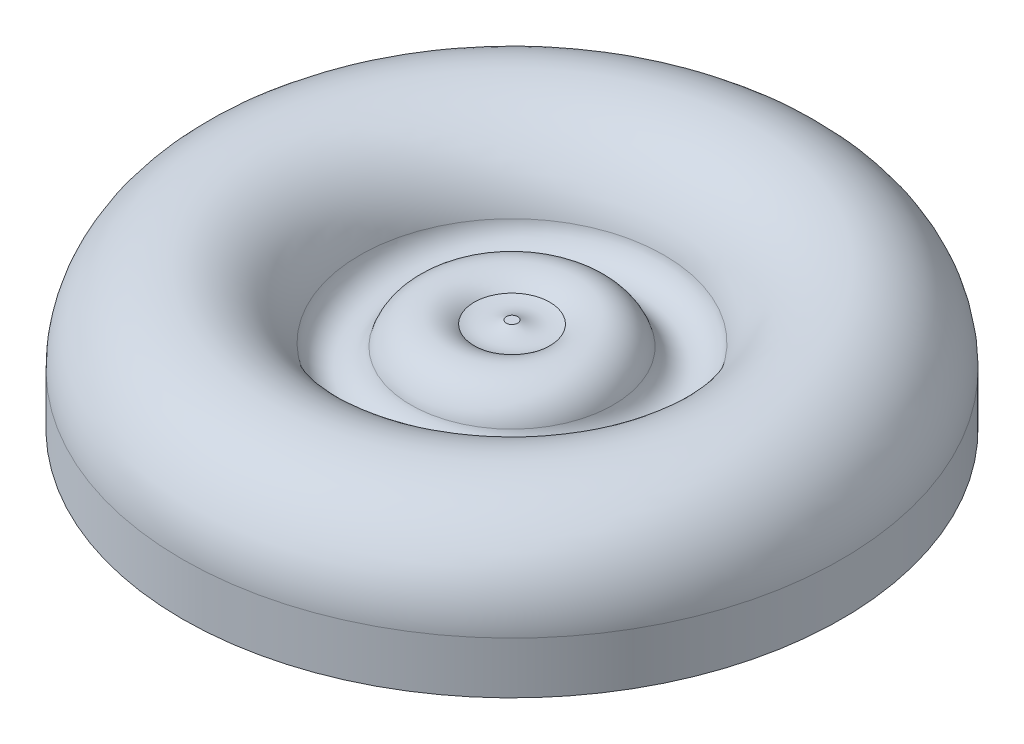
ISO-10303-21;
HEADER;
FILE_DESCRIPTION(('STEP AP214'),'2;1');
FILE_NAME('part.step','',(''),(''),'','','');
FILE_SCHEMA(('AUTOMOTIVE_DESIGN { 1 0 10303 214 1 1 1 1 }'));
ENDSEC;
DATA;
#1=APPLICATION_CONTEXT('core data for automotive mechanical design processes');
#2=APPLICATION_PROTOCOL_DEFINITION('international standard','automotive_design',2000,#1);
#3=PRODUCT_CONTEXT('',#1,'mechanical');
#4=PRODUCT('Part','Part','',(#3));
#5=PRODUCT_RELATED_PRODUCT_CATEGORY('part','',(#4));
#6=PRODUCT_DEFINITION_FORMATION('','',#4);
#7=PRODUCT_DEFINITION_CONTEXT('part definition',#1,'design');
#8=PRODUCT_DEFINITION('design','',#6,#7);
#9=PRODUCT_DEFINITION_SHAPE('','',#8);
#10=(LENGTH_UNIT() NAMED_UNIT(*) SI_UNIT(.MILLI.,.METRE.));
#11=(NAMED_UNIT(*) PLANE_ANGLE_UNIT() SI_UNIT($,.RADIAN.));
#12=(NAMED_UNIT(*) SI_UNIT($,.STERADIAN.) SOLID_ANGLE_UNIT());
#13=UNCERTAINTY_MEASURE_WITH_UNIT(LENGTH_MEASURE(1.E-05),#10,'distance_accuracy_value','');
#14=(GEOMETRIC_REPRESENTATION_CONTEXT(3) GLOBAL_UNCERTAINTY_ASSIGNED_CONTEXT((#13)) GLOBAL_UNIT_ASSIGNED_CONTEXT((#10,
#11,#12)) REPRESENTATION_CONTEXT('',''));
#15=CARTESIAN_POINT('',(0.,0.,0.));
#16=DIRECTION('',(0.,0.,1.));
#17=DIRECTION('',(1.,0.,0.));
#18=AXIS2_PLACEMENT_3D('',#15,#16,#17);
#19=CARTESIAN_POINT('',(0.,0.,0.));
#20=DIRECTION('',(0.,-1.,0.));
#21=DIRECTION('',(0.,0.,-1.));
#22=AXIS2_PLACEMENT_3D('',#19,#20,#21);
#23=PLANE('',#22);
#24=CARTESIAN_POINT('',(-45.466,0.,0.));
#25=DIRECTION('',(0.,-1.,0.));
#26=DIRECTION('',(0.,0.,-1.));
#27=AXIS2_PLACEMENT_3D('',#24,#25,#26);
#28=CIRCLE('',#27,45.466);
#29=CARTESIAN_POINT('',(-45.466,0.,-45.466));
#30=VERTEX_POINT('',#29);
#31=EDGE_CURVE('E12',#30,#30,#28,.T.);
#32=ORIENTED_EDGE('',*,*,#31,.T.);
#33=EDGE_LOOP('',(#32));
#34=FACE_BOUND('',#33,.T.);
#35=ADVANCED_FACE('F40',(#34),#23,.T.);
#36=CARTESIAN_POINT('',(-45.466,0.,0.));
#37=DIRECTION('',(0.,-1.,0.));
#38=DIRECTION('',(0.,0.,-1.));
#39=AXIS2_PLACEMENT_3D('',#36,#37,#38);
#40=CYLINDRICAL_SURFACE('',#39,45.466);
#41=CARTESIAN_POINT('',(-45.466,7.14024036987697,0.));
#42=DIRECTION('',(0.,-1.,0.));
#43=DIRECTION('',(0.,0.,-1.));
#44=AXIS2_PLACEMENT_3D('',#41,#42,#43);
#45=CIRCLE('',#44,45.466);
#46=CARTESIAN_POINT('',(-45.466,7.14024036987697,-45.466));
#47=VERTEX_POINT('',#46);
#48=EDGE_CURVE('E46',#47,#47,#45,.T.);
#49=ORIENTED_EDGE('',*,*,#48,.T.);
#50=EDGE_LOOP('',(#49));
#51=FACE_BOUND('',#50,.T.);
#52=ORIENTED_EDGE('',*,*,#31,.F.);
#53=EDGE_LOOP('',(#52));
#54=FACE_BOUND('',#53,.T.);
#55=ADVANCED_FACE('F78',(#51,#54),#40,.T.);
#56=CARTESIAN_POINT('',(-45.466,7.14024036987697,0.));
#57=DIRECTION('',(0.,-1.,0.));
#58=DIRECTION('',(0.,0.,-1.));
#59=AXIS2_PLACEMENT_3D('',#56,#57,#58);
#60=TOROIDAL_SURFACE('',#59,33.02,12.446);
#61=CARTESIAN_POINT('',(-45.466,10.2794502874989,0.));
#62=DIRECTION('',(0.,-1.,0.));
#63=DIRECTION('',(0.,0.,-1.));
#64=AXIS2_PLACEMENT_3D('',#61,#62,#63);
#65=CIRCLE('',#64,20.9764009908539);
#66=CARTESIAN_POINT('',(-45.466,10.2794502874989,-20.9764009908539));
#67=VERTEX_POINT('',#66);
#68=EDGE_CURVE('E50',#67,#67,#65,.T.);
#69=ORIENTED_EDGE('',*,*,#68,.T.);
#70=EDGE_LOOP('',(#69));
#71=FACE_BOUND('',#70,.T.);
#72=ORIENTED_EDGE('',*,*,#48,.F.);
#73=EDGE_LOOP('',(#72));
#74=FACE_BOUND('',#73,.T.);
#75=ADVANCED_FACE('F82',(#71,#74),#60,.T.);
#76=CARTESIAN_POINT('',(-45.466,10.9732893408499,0.));
#77=DIRECTION('',(0.,-1.,0.));
#78=DIRECTION('',(0.,0.,-1.));
#79=AXIS2_PLACEMENT_3D('',#76,#77,#78);
#80=TOROIDAL_SURFACE('',#79,17.4110869502616,3.63219999999999);
#81=CARTESIAN_POINT('',(-45.466,9.82833888999804,0.));
#82=DIRECTION('',(0.,-1.,0.));
#83=DIRECTION('',(0.,0.,-1.));
#84=AXIS2_PLACEMENT_3D('',#81,#82,#83);
#85=CIRCLE('',#84,13.9640642777086);
#86=CARTESIAN_POINT('',(-45.466,9.82833888999804,-13.9640642777086));
#87=VERTEX_POINT('',#86);
#88=EDGE_CURVE('E54',#87,#87,#85,.T.);
#89=ORIENTED_EDGE('',*,*,#88,.T.);
#90=EDGE_LOOP('',(#89));
#91=FACE_BOUND('',#90,.T.);
#92=ORIENTED_EDGE('',*,*,#68,.F.);
#93=EDGE_LOOP('',(#92));
#94=FACE_BOUND('',#93,.T.);
#95=ADVANCED_FACE('F86',(#91,#94),#80,.F.);
#96=CARTESIAN_POINT('',(-45.466,8.38248934084987,0.));
#97=DIRECTION('',(0.,-1.,0.));
#98=DIRECTION('',(0.,0.,-1.));
#99=AXIS2_PLACEMENT_3D('',#96,#97,#98);
#100=TOROIDAL_SURFACE('',#99,8.72428695026159,5.4356);
#101=CARTESIAN_POINT('',(-45.466,12.5306248017667,0.));
#102=DIRECTION('',(0.,-1.,0.));
#103=DIRECTION('',(0.,0.,-1.));
#104=AXIS2_PLACEMENT_3D('',#101,#102,#103);
#105=CIRCLE('',#104,5.21163559296976);
#106=CARTESIAN_POINT('',(-45.466,12.5306248017667,-5.21163559296976));
#107=VERTEX_POINT('',#106);
#108=EDGE_CURVE('E59',#107,#107,#105,.T.);
#109=ORIENTED_EDGE('',*,*,#108,.T.);
#110=EDGE_LOOP('',(#109));
#111=FACE_BOUND('',#110,.T.);
#112=ORIENTED_EDGE('',*,*,#88,.F.);
#113=EDGE_LOOP('',(#112));
#114=FACE_BOUND('',#113,.T.);
#115=ADVANCED_FACE('F75',(#111,#114),#100,.T.);
#116=CARTESIAN_POINT('',(-45.466,18.0344893408499,0.));
#117=DIRECTION('',(0.,-1.,0.));
#118=DIRECTION('',(0.,0.,-1.));
#119=AXIS2_PLACEMENT_3D('',#116,#117,#118);
#120=DEGENERATE_TOROIDAL_SURFACE('',#119,3.58078695026159,5.7404,.T.);
#121=CARTESIAN_POINT('',(-45.466,13.0195933792064,0.));
#122=DIRECTION('',(0.,-1.,0.));
#123=DIRECTION('',(0.,0.,-1.));
#124=AXIS2_PLACEMENT_3D('',#121,#122,#123);
#125=CIRCLE('',#124,0.787400000000001);
#126=CARTESIAN_POINT('',(-45.466,13.0195933792064,-0.787400000000001));
#127=VERTEX_POINT('',#126);
#128=EDGE_CURVE('E62',#127,#127,#125,.T.);
#129=ORIENTED_EDGE('',*,*,#128,.T.);
#130=EDGE_LOOP('',(#129));
#131=FACE_BOUND('',#130,.T.);
#132=ORIENTED_EDGE('',*,*,#108,.F.);
#133=EDGE_LOOP('',(#132));
#134=FACE_BOUND('',#133,.T.);
#135=ADVANCED_FACE('F66',(#131,#134),#120,.F.);
#136=CARTESIAN_POINT('',(-45.466,13.0195933792064,0.));
#137=DIRECTION('',(0.,1.,0.));
#138=DIRECTION('',(0.,0.,1.));
#139=AXIS2_PLACEMENT_3D('',#136,#137,#138);
#140=PLANE('',#139);
#141=ORIENTED_EDGE('',*,*,#128,.F.);
#142=EDGE_LOOP('',(#141));
#143=FACE_BOUND('',#142,.T.);
#144=ADVANCED_FACE('F69',(#143),#140,.T.);
#145=CLOSED_SHELL('',(#35,#55,#75,#95,#115,#135,#144));
#146=MANIFOLD_SOLID_BREP('B2',#145);
#147=ADVANCED_BREP_SHAPE_REPRESENTATION('',(#18,#146),#14);
#148=SHAPE_DEFINITION_REPRESENTATION(#9,#147);
ENDSEC;
END-ISO-10303-21;
